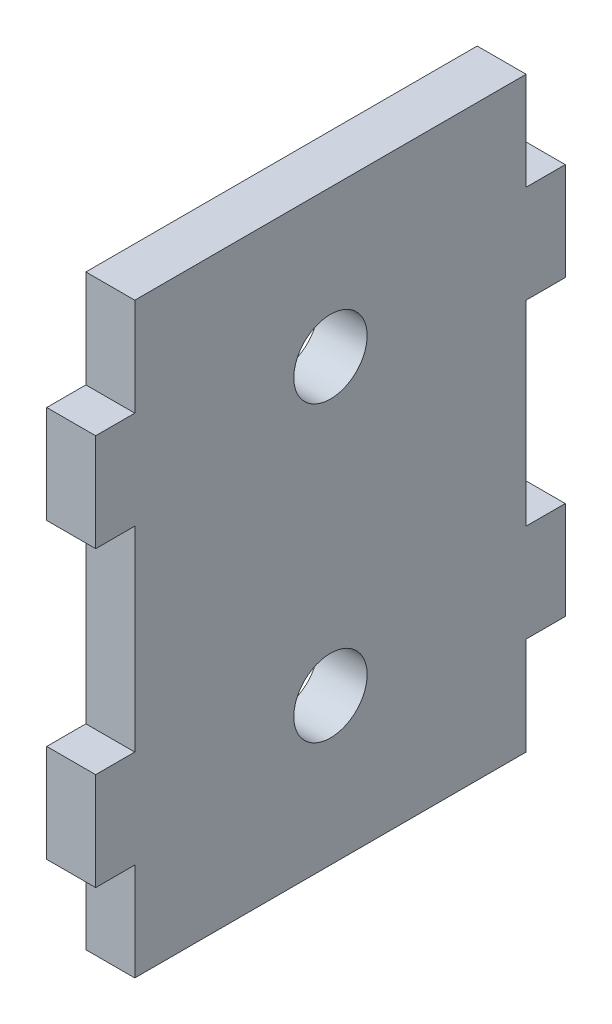
ISO-10303-21;
HEADER;
FILE_DESCRIPTION(('STEP AP214'),'2;1');
FILE_NAME('part.step','',(''),(''),'','','');
FILE_SCHEMA(('AUTOMOTIVE_DESIGN { 1 0 10303 214 1 1 1 1 }'));
ENDSEC;
DATA;
#1=APPLICATION_CONTEXT('core data for automotive mechanical design processes');
#2=APPLICATION_PROTOCOL_DEFINITION('international standard','automotive_design',2000,#1);
#3=PRODUCT_CONTEXT('',#1,'mechanical');
#4=PRODUCT('Part','Part','',(#3));
#5=PRODUCT_RELATED_PRODUCT_CATEGORY('part','',(#4));
#6=PRODUCT_DEFINITION_FORMATION('','',#4);
#7=PRODUCT_DEFINITION_CONTEXT('part definition',#1,'design');
#8=PRODUCT_DEFINITION('design','',#6,#7);
#9=PRODUCT_DEFINITION_SHAPE('','',#8);
#10=(LENGTH_UNIT() NAMED_UNIT(*) SI_UNIT(.MILLI.,.METRE.));
#11=(NAMED_UNIT(*) PLANE_ANGLE_UNIT() SI_UNIT($,.RADIAN.));
#12=(NAMED_UNIT(*) SI_UNIT($,.STERADIAN.) SOLID_ANGLE_UNIT());
#13=UNCERTAINTY_MEASURE_WITH_UNIT(LENGTH_MEASURE(1.E-05),#10,'distance_accuracy_value','');
#14=(GEOMETRIC_REPRESENTATION_CONTEXT(3) GLOBAL_UNCERTAINTY_ASSIGNED_CONTEXT((#13)) GLOBAL_UNIT_ASSIGNED_CONTEXT((#10,
#11,#12)) REPRESENTATION_CONTEXT('',''));
#15=CARTESIAN_POINT('',(0.,0.,0.));
#16=DIRECTION('',(0.,0.,1.));
#17=DIRECTION('',(1.,0.,0.));
#18=AXIS2_PLACEMENT_3D('',#15,#16,#17);
#19=CARTESIAN_POINT('',(-240.,3.33066907387547E-13,-640.));
#20=DIRECTION('',(0.,0.,1.));
#21=DIRECTION('',(1.,0.,0.));
#22=AXIS2_PLACEMENT_3D('',#19,#20,#21);
#23=PLANE('',#22);
#24=DIRECTION('',(-1.,0.,0.));
#25=VECTOR('',#24,1.);
#26=CARTESIAN_POINT('',(-240.,110.,-640.000000000001));
#27=LINE('',#26,#25);
#28=CARTESIAN_POINT('',(-240.,110.,-640.000000000001));
#29=VERTEX_POINT('',#28);
#30=CARTESIAN_POINT('',(-250.,110.000000000001,-640.));
#31=VERTEX_POINT('',#30);
#32=EDGE_CURVE('E48',#29,#31,#27,.T.);
#33=ORIENTED_EDGE('',*,*,#32,.F.);
#34=DIRECTION('',(0.,1.,0.));
#35=VECTOR('',#34,1.);
#36=CARTESIAN_POINT('',(-240.,3.33066907387547E-13,-640.));
#37=LINE('',#36,#35);
#38=CARTESIAN_POINT('',(-240.,70.0000000000005,-640.));
#39=VERTEX_POINT('',#38);
#40=EDGE_CURVE('E234',#39,#29,#37,.T.);
#41=ORIENTED_EDGE('',*,*,#40,.F.);
#42=DIRECTION('',(-1.,0.,0.));
#43=VECTOR('',#42,1.);
#44=CARTESIAN_POINT('',(-240.,70.0000000000005,-640.));
#45=LINE('',#44,#43);
#46=CARTESIAN_POINT('',(-250.,70.0000000000001,-640.));
#47=VERTEX_POINT('',#46);
#48=EDGE_CURVE('E121',#39,#47,#45,.T.);
#49=ORIENTED_EDGE('',*,*,#48,.T.);
#50=DIRECTION('',(0.,1.,0.));
#51=VECTOR('',#50,1.);
#52=CARTESIAN_POINT('',(-250.,4.44089209850063E-13,-640.));
#53=LINE('',#52,#51);
#54=EDGE_CURVE('E188',#47,#31,#53,.T.);
#55=ORIENTED_EDGE('',*,*,#54,.T.);
#56=EDGE_LOOP('',(#33,#41,#49,#55));
#57=FACE_BOUND('',#56,.T.);
#58=ADVANCED_FACE('F38',(#57),#23,.F.);
#59=CARTESIAN_POINT('',(-240.,30.0000000000004,0.));
#60=DIRECTION('',(0.,-1.,0.));
#61=DIRECTION('',(0.,0.,-1.));
#62=AXIS2_PLACEMENT_3D('',#59,#60,#61);
#63=PLANE('',#62);
#64=DIRECTION('',(0.,0.,1.));
#65=VECTOR('',#64,1.);
#66=CARTESIAN_POINT('',(-250.,30.0000000000002,0.));
#67=LINE('',#66,#65);
#68=CARTESIAN_POINT('',(-250.,30.0000000000001,-640.));
#69=VERTEX_POINT('',#68);
#70=CARTESIAN_POINT('',(-250.,30.0000000000001,-560.));
#71=VERTEX_POINT('',#70);
#72=EDGE_CURVE('E202',#69,#71,#67,.T.);
#73=ORIENTED_EDGE('',*,*,#72,.F.);
#74=DIRECTION('',(-1.,0.,0.));
#75=VECTOR('',#74,1.);
#76=CARTESIAN_POINT('',(-240.,30.0000000000005,-640.));
#77=LINE('',#76,#75);
#78=CARTESIAN_POINT('',(-240.,30.0000000000005,-640.));
#79=VERTEX_POINT('',#78);
#80=EDGE_CURVE('E109',#79,#69,#77,.T.);
#81=ORIENTED_EDGE('',*,*,#80,.F.);
#82=DIRECTION('',(0.,0.,1.));
#83=VECTOR('',#82,1.);
#84=CARTESIAN_POINT('',(-240.,30.0000000000004,0.));
#85=LINE('',#84,#83);
#86=CARTESIAN_POINT('',(-240.,30.0000000000004,-560.));
#87=VERTEX_POINT('',#86);
#88=EDGE_CURVE('E248',#79,#87,#85,.T.);
#89=ORIENTED_EDGE('',*,*,#88,.T.);
#90=DIRECTION('',(-1.,0.,0.));
#91=VECTOR('',#90,1.);
#92=CARTESIAN_POINT('',(-240.,30.0000000000004,-560.));
#93=LINE('',#92,#91);
#94=EDGE_CURVE('E154',#87,#71,#93,.T.);
#95=ORIENTED_EDGE('',*,*,#94,.T.);
#96=EDGE_LOOP('',(#73,#81,#89,#95));
#97=FACE_BOUND('',#96,.T.);
#98=ADVANCED_FACE('F385',(#97),#63,.T.);
#99=CARTESIAN_POINT('',(-250.,50.0000000000005,-640.));
#100=VERTEX_POINT('',#99);
#101=EDGE_CURVE('E199',#69,#100,#53,.T.);
#102=ORIENTED_EDGE('',*,*,#101,.T.);
#103=DIRECTION('',(-1.,0.,0.));
#104=VECTOR('',#103,1.);
#105=CARTESIAN_POINT('',(-240.,50.,-640.));
#106=LINE('',#105,#104);
#107=CARTESIAN_POINT('',(-240.,50.,-640.));
#108=VERTEX_POINT('',#107);
#109=EDGE_CURVE('E112',#108,#100,#106,.T.);
#110=ORIENTED_EDGE('',*,*,#109,.F.);
#111=EDGE_CURVE('E245',#79,#108,#37,.T.);
#112=ORIENTED_EDGE('',*,*,#111,.F.);
#113=ORIENTED_EDGE('',*,*,#80,.T.);
#114=EDGE_LOOP('',(#102,#110,#112,#113));
#115=FACE_BOUND('',#114,.T.);
#116=ADVANCED_FACE('F381',(#115),#23,.F.);
#117=CARTESIAN_POINT('',(-240.,50.0000000000002,0.));
#118=DIRECTION('',(0.,1.,0.));
#119=DIRECTION('',(0.,0.,1.));
#120=AXIS2_PLACEMENT_3D('',#117,#118,#119);
#121=PLANE('',#120);
#122=DIRECTION('',(0.,0.,-1.));
#123=VECTOR('',#122,1.);
#124=CARTESIAN_POINT('',(-250.,50.0000000000004,1.38777878078145E-13));
#125=LINE('',#124,#123);
#126=CARTESIAN_POINT('',(-250.,50.0000000000002,-648.));
#127=VERTEX_POINT('',#126);
#128=EDGE_CURVE('E196',#100,#127,#125,.T.);
#129=ORIENTED_EDGE('',*,*,#128,.T.);
#130=DIRECTION('',(-1.,0.,0.));
#131=VECTOR('',#130,1.);
#132=CARTESIAN_POINT('',(-240.,50.0000000000004,-648.));
#133=LINE('',#132,#131);
#134=CARTESIAN_POINT('',(-240.,50.0000000000004,-648.));
#135=VERTEX_POINT('',#134);
#136=EDGE_CURVE('E115',#135,#127,#133,.T.);
#137=ORIENTED_EDGE('',*,*,#136,.F.);
#138=DIRECTION('',(0.,0.,-1.));
#139=VECTOR('',#138,1.);
#140=CARTESIAN_POINT('',(-240.,50.0000000000002,0.));
#141=LINE('',#140,#139);
#142=EDGE_CURVE('E242',#108,#135,#141,.T.);
#143=ORIENTED_EDGE('',*,*,#142,.F.);
#144=ORIENTED_EDGE('',*,*,#109,.T.);
#145=EDGE_LOOP('',(#129,#137,#143,#144));
#146=FACE_BOUND('',#145,.T.);
#147=ADVANCED_FACE('F392',(#146),#121,.F.);
#148=CARTESIAN_POINT('',(-240.,5.55111512312578E-13,-648.));
#149=DIRECTION('',(0.,0.,-1.));
#150=DIRECTION('',(-1.,0.,0.));
#151=AXIS2_PLACEMENT_3D('',#148,#149,#150);
#152=PLANE('',#151);
#153=DIRECTION('',(0.,-1.,0.));
#154=VECTOR('',#153,1.);
#155=CARTESIAN_POINT('',(-250.,1.11022302462516E-13,-648.));
#156=LINE('',#155,#154);
#157=CARTESIAN_POINT('',(-250.,70.0000000000004,-648.000000000001));
#158=VERTEX_POINT('',#157);
#159=EDGE_CURVE('E193',#158,#127,#156,.T.);
#160=ORIENTED_EDGE('',*,*,#159,.F.);
#161=DIRECTION('',(-1.,0.,0.));
#162=VECTOR('',#161,1.);
#163=CARTESIAN_POINT('',(-240.,70.0000000000003,-648.));
#164=LINE('',#163,#162);
#165=CARTESIAN_POINT('',(-240.,70.0000000000003,-648.));
#166=VERTEX_POINT('',#165);
#167=EDGE_CURVE('E118',#166,#158,#164,.T.);
#168=ORIENTED_EDGE('',*,*,#167,.F.);
#169=DIRECTION('',(0.,-1.,0.));
#170=VECTOR('',#169,1.);
#171=CARTESIAN_POINT('',(-240.,5.55111512312578E-13,-648.));
#172=LINE('',#171,#170);
#173=EDGE_CURVE('E239',#166,#135,#172,.T.);
#174=ORIENTED_EDGE('',*,*,#173,.T.);
#175=ORIENTED_EDGE('',*,*,#136,.T.);
#176=EDGE_LOOP('',(#160,#168,#174,#175));
#177=FACE_BOUND('',#176,.T.);
#178=ADVANCED_FACE('F308',(#177),#152,.T.);
#179=CARTESIAN_POINT('',(-240.,70.,3.05311331771918E-13));
#180=DIRECTION('',(0.,1.,0.));
#181=DIRECTION('',(0.,0.,1.));
#182=AXIS2_PLACEMENT_3D('',#179,#180,#181);
#183=PLANE('',#182);
#184=DIRECTION('',(0.,0.,-1.));
#185=VECTOR('',#184,1.);
#186=CARTESIAN_POINT('',(-250.,70.0000000000002,0.));
#187=LINE('',#186,#185);
#188=EDGE_CURVE('E189',#47,#158,#187,.T.);
#189=ORIENTED_EDGE('',*,*,#188,.F.);
#190=ORIENTED_EDGE('',*,*,#48,.F.);
#191=DIRECTION('',(0.,0.,-1.));
#192=VECTOR('',#191,1.);
#193=CARTESIAN_POINT('',(-240.,70.,3.05311331771918E-13));
#194=LINE('',#193,#192);
#195=EDGE_CURVE('E235',#39,#166,#194,.T.);
#196=ORIENTED_EDGE('',*,*,#195,.T.);
#197=ORIENTED_EDGE('',*,*,#167,.T.);
#198=EDGE_LOOP('',(#189,#190,#196,#197));
#199=FACE_BOUND('',#198,.T.);
#200=ADVANCED_FACE('F298',(#199),#183,.T.);
#201=CARTESIAN_POINT('',(-240.,130.,-640.));
#202=VERTEX_POINT('',#201);
#203=CARTESIAN_POINT('',(-240.,150.,-640.000000000001));
#204=VERTEX_POINT('',#203);
#205=EDGE_CURVE('E238',#202,#204,#37,.T.);
#206=ORIENTED_EDGE('',*,*,#205,.F.);
#207=DIRECTION('',(-1.,0.,0.));
#208=VECTOR('',#207,1.);
#209=CARTESIAN_POINT('',(-240.,130.,-640.));
#210=LINE('',#209,#208);
#211=CARTESIAN_POINT('',(-250.,130.,-640.));
#212=VERTEX_POINT('',#211);
#213=EDGE_CURVE('E11',#202,#212,#210,.T.);
#214=ORIENTED_EDGE('',*,*,#213,.T.);
#215=CARTESIAN_POINT('',(-250.,150.,-640.));
#216=VERTEX_POINT('',#215);
#217=EDGE_CURVE('E192',#212,#216,#53,.T.);
#218=ORIENTED_EDGE('',*,*,#217,.T.);
#219=DIRECTION('',(-1.,0.,0.));
#220=VECTOR('',#219,1.);
#221=CARTESIAN_POINT('',(-240.,150.,-640.000000000001));
#222=LINE('',#221,#220);
#223=EDGE_CURVE('E124',#204,#216,#222,.T.);
#224=ORIENTED_EDGE('',*,*,#223,.F.);
#225=EDGE_LOOP('',(#206,#214,#218,#224));
#226=FACE_BOUND('',#225,.T.);
#227=ADVANCED_FACE('F394',(#226),#23,.F.);
#228=CARTESIAN_POINT('',(-240.,150.,0.));
#229=DIRECTION('',(0.,-1.,0.));
#230=DIRECTION('',(0.,0.,-1.));
#231=AXIS2_PLACEMENT_3D('',#228,#229,#230);
#232=PLANE('',#231);
#233=DIRECTION('',(0.,0.,1.));
#234=VECTOR('',#233,1.);
#235=CARTESIAN_POINT('',(-250.,150.,0.));
#236=LINE('',#235,#234);
#237=CARTESIAN_POINT('',(-250.,150.,-560.));
#238=VERTEX_POINT('',#237);
#239=EDGE_CURVE('E185',#216,#238,#236,.T.);
#240=ORIENTED_EDGE('',*,*,#239,.T.);
#241=DIRECTION('',(-1.,0.,0.));
#242=VECTOR('',#241,1.);
#243=CARTESIAN_POINT('',(-240.,150.,-560.000000000001));
#244=LINE('',#243,#242);
#245=CARTESIAN_POINT('',(-240.,150.,-560.000000000001));
#246=VERTEX_POINT('',#245);
#247=EDGE_CURVE('E127',#246,#238,#244,.T.);
#248=ORIENTED_EDGE('',*,*,#247,.F.);
#249=DIRECTION('',(0.,0.,1.));
#250=VECTOR('',#249,1.);
#251=CARTESIAN_POINT('',(-240.,150.,0.));
#252=LINE('',#251,#250);
#253=EDGE_CURVE('E231',#204,#246,#252,.T.);
#254=ORIENTED_EDGE('',*,*,#253,.F.);
#255=ORIENTED_EDGE('',*,*,#223,.T.);
#256=EDGE_LOOP('',(#240,#248,#254,#255));
#257=FACE_BOUND('',#256,.T.);
#258=ADVANCED_FACE('F416',(#257),#232,.F.);
#259=CARTESIAN_POINT('',(-240.,-2.22044604925031E-13,-560.));
#260=DIRECTION('',(0.,0.,1.));
#261=DIRECTION('',(0.,-1.,0.));
#262=AXIS2_PLACEMENT_3D('',#259,#260,#261);
#263=PLANE('',#262);
#264=DIRECTION('',(0.,1.,0.));
#265=VECTOR('',#264,1.);
#266=CARTESIAN_POINT('',(-250.,-1.11022302462516E-13,-560.000000000001));
#267=LINE('',#266,#265);
#268=CARTESIAN_POINT('',(-250.,130.,-560.));
#269=VERTEX_POINT('',#268);
#270=EDGE_CURVE('E182',#269,#238,#267,.T.);
#271=ORIENTED_EDGE('',*,*,#270,.F.);
#272=DIRECTION('',(-1.,0.,0.));
#273=VECTOR('',#272,1.);
#274=CARTESIAN_POINT('',(-240.,130.,-560.000000000001));
#275=LINE('',#274,#273);
#276=CARTESIAN_POINT('',(-240.,130.,-560.000000000001));
#277=VERTEX_POINT('',#276);
#278=EDGE_CURVE('E130',#277,#269,#275,.T.);
#279=ORIENTED_EDGE('',*,*,#278,.F.);
#280=DIRECTION('',(0.,1.,0.));
#281=VECTOR('',#280,1.);
#282=CARTESIAN_POINT('',(-240.,-2.22044604925031E-13,-560.));
#283=LINE('',#282,#281);
#284=EDGE_CURVE('E228',#277,#246,#283,.T.);
#285=ORIENTED_EDGE('',*,*,#284,.T.);
#286=ORIENTED_EDGE('',*,*,#247,.T.);
#287=EDGE_LOOP('',(#271,#279,#285,#286));
#288=FACE_BOUND('',#287,.T.);
#289=ADVANCED_FACE('F406',(#288),#263,.T.);
#290=CARTESIAN_POINT('',(-240.,130.,0.));
#291=DIRECTION('',(0.,-1.,0.));
#292=DIRECTION('',(0.,0.,-1.));
#293=AXIS2_PLACEMENT_3D('',#290,#291,#292);
#294=PLANE('',#293);
#295=DIRECTION('',(0.,0.,1.));
#296=VECTOR('',#295,1.);
#297=CARTESIAN_POINT('',(-250.,130.,1.38777878078145E-13));
#298=LINE('',#297,#296);
#299=CARTESIAN_POINT('',(-250.,130.000000000001,-552.));
#300=VERTEX_POINT('',#299);
#301=EDGE_CURVE('E179',#269,#300,#298,.T.);
#302=ORIENTED_EDGE('',*,*,#301,.T.);
#303=DIRECTION('',(-1.,0.,0.));
#304=VECTOR('',#303,1.);
#305=CARTESIAN_POINT('',(-240.,130.,-552.));
#306=LINE('',#305,#304);
#307=CARTESIAN_POINT('',(-240.,130.,-552.));
#308=VERTEX_POINT('',#307);
#309=EDGE_CURVE('E133',#308,#300,#306,.T.);
#310=ORIENTED_EDGE('',*,*,#309,.F.);
#311=DIRECTION('',(0.,0.,1.));
#312=VECTOR('',#311,1.);
#313=CARTESIAN_POINT('',(-240.,130.,0.));
#314=LINE('',#313,#312);
#315=EDGE_CURVE('E225',#277,#308,#314,.T.);
#316=ORIENTED_EDGE('',*,*,#315,.F.);
#317=ORIENTED_EDGE('',*,*,#278,.T.);
#318=EDGE_LOOP('',(#302,#310,#316,#317));
#319=FACE_BOUND('',#318,.T.);
#320=ADVANCED_FACE('F415',(#319),#294,.F.);
#321=CARTESIAN_POINT('',(-240.,-2.77555756156289E-12,-551.999999999999));
#322=DIRECTION('',(0.,0.,-1.));
#323=DIRECTION('',(0.,0.999999999999999,0.));
#324=AXIS2_PLACEMENT_3D('',#321,#322,#323);
#325=PLANE('',#324);
#326=DIRECTION('',(0.,-0.999999999999999,0.));
#327=VECTOR('',#326,1.);
#328=CARTESIAN_POINT('',(-250.,-2.88657986402541E-12,-552.));
#329=LINE('',#328,#327);
#330=CARTESIAN_POINT('',(-250.,110.,-552.));
#331=VERTEX_POINT('',#330);
#332=EDGE_CURVE('E176',#300,#331,#329,.T.);
#333=ORIENTED_EDGE('',*,*,#332,.T.);
#334=DIRECTION('',(-1.,0.,0.));
#335=VECTOR('',#334,1.);
#336=CARTESIAN_POINT('',(-240.,110.,-552.));
#337=LINE('',#336,#335);
#338=CARTESIAN_POINT('',(-240.,110.,-552.));
#339=VERTEX_POINT('',#338);
#340=EDGE_CURVE('E136',#339,#331,#337,.T.);
#341=ORIENTED_EDGE('',*,*,#340,.F.);
#342=DIRECTION('',(0.,-0.999999999999999,0.));
#343=VECTOR('',#342,1.);
#344=CARTESIAN_POINT('',(-240.,-2.77555756156289E-12,-551.999999999999));
#345=LINE('',#344,#343);
#346=EDGE_CURVE('E222',#308,#339,#345,.T.);
#347=ORIENTED_EDGE('',*,*,#346,.F.);
#348=ORIENTED_EDGE('',*,*,#309,.T.);
#349=EDGE_LOOP('',(#333,#341,#347,#348));
#350=FACE_BOUND('',#349,.T.);
#351=ADVANCED_FACE('F428',(#350),#325,.F.);
#352=CARTESIAN_POINT('',(-240.,110.,0.));
#353=DIRECTION('',(0.,-1.,0.));
#354=DIRECTION('',(0.,0.,-1.));
#355=AXIS2_PLACEMENT_3D('',#352,#353,#354);
#356=PLANE('',#355);
#357=DIRECTION('',(0.,0.,1.));
#358=VECTOR('',#357,1.);
#359=CARTESIAN_POINT('',(-250.,110.,0.));
#360=LINE('',#359,#358);
#361=CARTESIAN_POINT('',(-250.,110.000000000001,-560.));
#362=VERTEX_POINT('',#361);
#363=EDGE_CURVE('E173',#362,#331,#360,.T.);
#364=ORIENTED_EDGE('',*,*,#363,.F.);
#365=DIRECTION('',(-1.,0.,0.));
#366=VECTOR('',#365,1.);
#367=CARTESIAN_POINT('',(-240.,110.,-560.));
#368=LINE('',#367,#366);
#369=CARTESIAN_POINT('',(-240.,110.,-560.));
#370=VERTEX_POINT('',#369);
#371=EDGE_CURVE('E139',#370,#362,#368,.T.);
#372=ORIENTED_EDGE('',*,*,#371,.F.);
#373=DIRECTION('',(0.,0.,1.));
#374=VECTOR('',#373,1.);
#375=CARTESIAN_POINT('',(-240.,110.,0.));
#376=LINE('',#375,#374);
#377=EDGE_CURVE('E219',#370,#339,#376,.T.);
#378=ORIENTED_EDGE('',*,*,#377,.T.);
#379=ORIENTED_EDGE('',*,*,#340,.T.);
#380=EDGE_LOOP('',(#364,#372,#378,#379));
#381=FACE_BOUND('',#380,.T.);
#382=ADVANCED_FACE('F420',(#381),#356,.T.);
#383=CARTESIAN_POINT('',(-250.,70.0000000000001,-560.));
#384=VERTEX_POINT('',#383);
#385=EDGE_CURVE('E172',#384,#362,#267,.T.);
#386=ORIENTED_EDGE('',*,*,#385,.F.);
#387=DIRECTION('',(-1.,0.,0.));
#388=VECTOR('',#387,1.);
#389=CARTESIAN_POINT('',(-240.,70.0000000000003,-560.000000000001));
#390=LINE('',#389,#388);
#391=CARTESIAN_POINT('',(-240.,70.0000000000003,-560.000000000001));
#392=VERTEX_POINT('',#391);
#393=EDGE_CURVE('E142',#392,#384,#390,.T.);
#394=ORIENTED_EDGE('',*,*,#393,.F.);
#395=EDGE_CURVE('E218',#392,#370,#283,.T.);
#396=ORIENTED_EDGE('',*,*,#395,.T.);
#397=ORIENTED_EDGE('',*,*,#371,.T.);
#398=EDGE_LOOP('',(#386,#394,#396,#397));
#399=FACE_BOUND('',#398,.T.);
#400=ADVANCED_FACE('F407',(#399),#263,.T.);
#401=CARTESIAN_POINT('',(-240.,70.,3.05311331771918E-13));
#402=DIRECTION('',(0.,-1.,0.));
#403=DIRECTION('',(0.,0.,-1.));
#404=AXIS2_PLACEMENT_3D('',#401,#402,#403);
#405=PLANE('',#404);
#406=DIRECTION('',(0.,0.,1.));
#407=VECTOR('',#406,1.);
#408=CARTESIAN_POINT('',(-250.,70.0000000000002,0.));
#409=LINE('',#408,#407);
#410=CARTESIAN_POINT('',(-250.,70.0000000000004,-552.));
#411=VERTEX_POINT('',#410);
#412=EDGE_CURVE('E169',#384,#411,#409,.T.);
#413=ORIENTED_EDGE('',*,*,#412,.T.);
#414=DIRECTION('',(-1.,0.,0.));
#415=VECTOR('',#414,1.);
#416=CARTESIAN_POINT('',(-240.,70.0000000000003,-552.));
#417=LINE('',#416,#415);
#418=CARTESIAN_POINT('',(-240.,70.0000000000003,-552.));
#419=VERTEX_POINT('',#418);
#420=EDGE_CURVE('E145',#419,#411,#417,.T.);
#421=ORIENTED_EDGE('',*,*,#420,.F.);
#422=DIRECTION('',(0.,0.,1.));
#423=VECTOR('',#422,1.);
#424=CARTESIAN_POINT('',(-240.,70.,3.05311331771918E-13));
#425=LINE('',#424,#423);
#426=EDGE_CURVE('E215',#392,#419,#425,.T.);
#427=ORIENTED_EDGE('',*,*,#426,.F.);
#428=ORIENTED_EDGE('',*,*,#393,.T.);
#429=EDGE_LOOP('',(#413,#421,#427,#428));
#430=FACE_BOUND('',#429,.T.);
#431=ADVANCED_FACE('F419',(#430),#405,.F.);
#432=CARTESIAN_POINT('',(-240.,3.33066907387547E-13,-552.));
#433=DIRECTION('',(0.,0.,-1.));
#434=DIRECTION('',(-1.,0.,0.));
#435=AXIS2_PLACEMENT_3D('',#432,#433,#434);
#436=PLANE('',#435);
#437=DIRECTION('',(0.,-1.,0.));
#438=VECTOR('',#437,1.);
#439=CARTESIAN_POINT('',(-250.,4.44089209850063E-13,-552.));
#440=LINE('',#439,#438);
#441=CARTESIAN_POINT('',(-250.,50.0000000000005,-552.));
#442=VERTEX_POINT('',#441);
#443=EDGE_CURVE('E166',#411,#442,#440,.T.);
#444=ORIENTED_EDGE('',*,*,#443,.T.);
#445=DIRECTION('',(-1.,0.,0.));
#446=VECTOR('',#445,1.);
#447=CARTESIAN_POINT('',(-240.,50.0000000000005,-552.));
#448=LINE('',#447,#446);
#449=CARTESIAN_POINT('',(-240.,50.0000000000005,-552.));
#450=VERTEX_POINT('',#449);
#451=EDGE_CURVE('E148',#450,#442,#448,.T.);
#452=ORIENTED_EDGE('',*,*,#451,.F.);
#453=DIRECTION('',(0.,-1.,0.));
#454=VECTOR('',#453,1.);
#455=CARTESIAN_POINT('',(-240.,3.33066907387547E-13,-552.));
#456=LINE('',#455,#454);
#457=EDGE_CURVE('E212',#419,#450,#456,.T.);
#458=ORIENTED_EDGE('',*,*,#457,.F.);
#459=ORIENTED_EDGE('',*,*,#420,.T.);
#460=EDGE_LOOP('',(#444,#452,#458,#459));
#461=FACE_BOUND('',#460,.T.);
#462=ADVANCED_FACE('F411',(#461),#436,.F.);
#463=CARTESIAN_POINT('',(-240.,50.0000000000002,0.));
#464=DIRECTION('',(0.,-1.,0.));
#465=DIRECTION('',(0.,0.,-1.));
#466=AXIS2_PLACEMENT_3D('',#463,#464,#465);
#467=PLANE('',#466);
#468=DIRECTION('',(0.,0.,1.));
#469=VECTOR('',#468,1.);
#470=CARTESIAN_POINT('',(-250.,50.0000000000004,1.38777878078145E-13));
#471=LINE('',#470,#469);
#472=CARTESIAN_POINT('',(-250.,50.0000000000004,-560.));
#473=VERTEX_POINT('',#472);
#474=EDGE_CURVE('E163',#473,#442,#471,.T.);
#475=ORIENTED_EDGE('',*,*,#474,.F.);
#476=DIRECTION('',(-1.,0.,0.));
#477=VECTOR('',#476,1.);
#478=CARTESIAN_POINT('',(-240.,49.9999999999999,-560.));
#479=LINE('',#478,#477);
#480=CARTESIAN_POINT('',(-240.,49.9999999999999,-560.));
#481=VERTEX_POINT('',#480);
#482=EDGE_CURVE('E151',#481,#473,#479,.T.);
#483=ORIENTED_EDGE('',*,*,#482,.F.);
#484=DIRECTION('',(0.,0.,1.));
#485=VECTOR('',#484,1.);
#486=CARTESIAN_POINT('',(-240.,50.0000000000002,0.));
#487=LINE('',#486,#485);
#488=EDGE_CURVE('E209',#481,#450,#487,.T.);
#489=ORIENTED_EDGE('',*,*,#488,.T.);
#490=ORIENTED_EDGE('',*,*,#451,.T.);
#491=EDGE_LOOP('',(#475,#483,#489,#490));
#492=FACE_BOUND('',#491,.T.);
#493=ADVANCED_FACE('F403',(#492),#467,.T.);
#494=EDGE_CURVE('E162',#71,#473,#267,.T.);
#495=ORIENTED_EDGE('',*,*,#494,.F.);
#496=ORIENTED_EDGE('',*,*,#94,.F.);
#497=EDGE_CURVE('E208',#87,#481,#283,.T.);
#498=ORIENTED_EDGE('',*,*,#497,.T.);
#499=ORIENTED_EDGE('',*,*,#482,.T.);
#500=EDGE_LOOP('',(#495,#496,#498,#499));
#501=FACE_BOUND('',#500,.T.);
#502=ADVANCED_FACE('F399',(#501),#263,.T.);
#503=CARTESIAN_POINT('',(-240.,120.,-600.));
#504=DIRECTION('',(-1.,0.,0.));
#505=DIRECTION('',(0.,0.,1.));
#506=AXIS2_PLACEMENT_3D('',#503,#504,#505);
#507=CYLINDRICAL_SURFACE('',#506,7.49999999999996);
#508=CARTESIAN_POINT('',(-240.,120.,-600.));
#509=DIRECTION('',(1.,0.,0.));
#510=DIRECTION('',(0.,0.,-1.));
#511=AXIS2_PLACEMENT_3D('',#508,#509,#510);
#512=CIRCLE('',#511,7.49999999999996);
#513=CARTESIAN_POINT('',(-240.,120.,-607.5));
#514=VERTEX_POINT('',#513);
#515=EDGE_CURVE('E161',#514,#514,#512,.T.);
#516=ORIENTED_EDGE('',*,*,#515,.T.);
#517=EDGE_LOOP('',(#516));
#518=FACE_BOUND('',#517,.T.);
#519=CARTESIAN_POINT('',(-250.,120.000000000001,-600.));
#520=DIRECTION('',(1.,0.,0.));
#521=DIRECTION('',(0.,0.,-1.));
#522=AXIS2_PLACEMENT_3D('',#519,#520,#521);
#523=CIRCLE('',#522,7.49999999999996);
#524=CARTESIAN_POINT('',(-250.,120.000000000001,-607.5));
#525=VERTEX_POINT('',#524);
#526=EDGE_CURVE('E85',#525,#525,#523,.T.);
#527=ORIENTED_EDGE('',*,*,#526,.F.);
#528=EDGE_LOOP('',(#527));
#529=FACE_BOUND('',#528,.T.);
#530=ADVANCED_FACE('F254',(#518,#529),#507,.F.);
#531=CARTESIAN_POINT('',(-240.,60.0000000000007,-600.));
#532=DIRECTION('',(-1.,0.,0.));
#533=DIRECTION('',(0.,0.,1.));
#534=AXIS2_PLACEMENT_3D('',#531,#532,#533);
#535=CYLINDRICAL_SURFACE('',#534,7.49999999999995);
#536=CARTESIAN_POINT('',(-240.,60.0000000000007,-600.));
#537=DIRECTION('',(1.,0.,0.));
#538=DIRECTION('',(0.,0.,-1.));
#539=AXIS2_PLACEMENT_3D('',#536,#537,#538);
#540=CIRCLE('',#539,7.49999999999995);
#541=CARTESIAN_POINT('',(-240.,60.0000000000007,-607.5));
#542=VERTEX_POINT('',#541);
#543=EDGE_CURVE('E157',#542,#542,#540,.T.);
#544=ORIENTED_EDGE('',*,*,#543,.T.);
#545=EDGE_LOOP('',(#544));
#546=FACE_BOUND('',#545,.T.);
#547=CARTESIAN_POINT('',(-250.,60.0000000000005,-600.));
#548=DIRECTION('',(1.,0.,0.));
#549=DIRECTION('',(0.,0.,-1.));
#550=AXIS2_PLACEMENT_3D('',#547,#548,#549);
#551=CIRCLE('',#550,7.49999999999995);
#552=CARTESIAN_POINT('',(-250.,60.0000000000005,-607.5));
#553=VERTEX_POINT('',#552);
#554=EDGE_CURVE('E158',#553,#553,#551,.T.);
#555=ORIENTED_EDGE('',*,*,#554,.F.);
#556=EDGE_LOOP('',(#555));
#557=FACE_BOUND('',#556,.T.);
#558=ADVANCED_FACE('F260',(#546,#557),#535,.F.);
#559=CARTESIAN_POINT('',(-240.,1.11022302462516E-13,3.05311331771918E-13));
#560=DIRECTION('',(1.,0.,0.));
#561=DIRECTION('',(0.,0.,-1.));
#562=AXIS2_PLACEMENT_3D('',#559,#560,#561);
#563=PLANE('',#562);
#564=ORIENTED_EDGE('',*,*,#515,.F.);
#565=EDGE_LOOP('',(#564));
#566=FACE_BOUND('',#565,.T.);
#567=ORIENTED_EDGE('',*,*,#88,.F.);
#568=ORIENTED_EDGE('',*,*,#111,.T.);
#569=ORIENTED_EDGE('',*,*,#142,.T.);
#570=ORIENTED_EDGE('',*,*,#173,.F.);
#571=ORIENTED_EDGE('',*,*,#195,.F.);
#572=ORIENTED_EDGE('',*,*,#40,.T.);
#573=DIRECTION('',(0.,0.,-1.));
#574=VECTOR('',#573,1.);
#575=CARTESIAN_POINT('',(-240.,110.,-640.000000000001));
#576=LINE('',#575,#574);
#577=CARTESIAN_POINT('',(-240.,110.,-648.));
#578=VERTEX_POINT('',#577);
#579=EDGE_CURVE('E104',#29,#578,#576,.T.);
#580=ORIENTED_EDGE('',*,*,#579,.T.);
#581=DIRECTION('',(0.,-1.,0.));
#582=VECTOR('',#581,1.);
#583=CARTESIAN_POINT('',(-240.,130.,-648.));
#584=LINE('',#583,#582);
#585=CARTESIAN_POINT('',(-240.,130.,-648.));
#586=VERTEX_POINT('',#585);
#587=EDGE_CURVE('E82',#586,#578,#584,.T.);
#588=ORIENTED_EDGE('',*,*,#587,.F.);
#589=DIRECTION('',(0.,0.,-1.));
#590=VECTOR('',#589,1.);
#591=CARTESIAN_POINT('',(-240.,130.,-640.));
#592=LINE('',#591,#590);
#593=EDGE_CURVE('E94',#202,#586,#592,.T.);
#594=ORIENTED_EDGE('',*,*,#593,.F.);
#595=ORIENTED_EDGE('',*,*,#205,.T.);
#596=ORIENTED_EDGE('',*,*,#253,.T.);
#597=ORIENTED_EDGE('',*,*,#284,.F.);
#598=ORIENTED_EDGE('',*,*,#315,.T.);
#599=ORIENTED_EDGE('',*,*,#346,.T.);
#600=ORIENTED_EDGE('',*,*,#377,.F.);
#601=ORIENTED_EDGE('',*,*,#395,.F.);
#602=ORIENTED_EDGE('',*,*,#426,.T.);
#603=ORIENTED_EDGE('',*,*,#457,.T.);
#604=ORIENTED_EDGE('',*,*,#488,.F.);
#605=ORIENTED_EDGE('',*,*,#497,.F.);
#606=EDGE_LOOP('',(#567,#568,#569,#570,#571,#572,#580,#588,#594,#595,#596,#597,#598,#599,#600,
#601,#602,#603,#604,#605));
#607=FACE_BOUND('',#606,.T.);
#608=ORIENTED_EDGE('',*,*,#543,.F.);
#609=EDGE_LOOP('',(#608));
#610=FACE_BOUND('',#609,.T.);
#611=ADVANCED_FACE('F257',(#566,#607,#610),#563,.T.);
#612=CARTESIAN_POINT('',(-250.,3.33066907387547E-13,0.));
#613=DIRECTION('',(1.,0.,0.));
#614=DIRECTION('',(0.,0.,-1.));
#615=AXIS2_PLACEMENT_3D('',#612,#613,#614);
#616=PLANE('',#615);
#617=ORIENTED_EDGE('',*,*,#526,.T.);
#618=EDGE_LOOP('',(#617));
#619=FACE_BOUND('',#618,.T.);
#620=ORIENTED_EDGE('',*,*,#72,.T.);
#621=ORIENTED_EDGE('',*,*,#494,.T.);
#622=ORIENTED_EDGE('',*,*,#474,.T.);
#623=ORIENTED_EDGE('',*,*,#443,.F.);
#624=ORIENTED_EDGE('',*,*,#412,.F.);
#625=ORIENTED_EDGE('',*,*,#385,.T.);
#626=ORIENTED_EDGE('',*,*,#363,.T.);
#627=ORIENTED_EDGE('',*,*,#332,.F.);
#628=ORIENTED_EDGE('',*,*,#301,.F.);
#629=ORIENTED_EDGE('',*,*,#270,.T.);
#630=ORIENTED_EDGE('',*,*,#239,.F.);
#631=ORIENTED_EDGE('',*,*,#217,.F.);
#632=DIRECTION('',(0.,0.,-1.));
#633=VECTOR('',#632,1.);
#634=CARTESIAN_POINT('',(-250.,130.,-640.));
#635=LINE('',#634,#633);
#636=CARTESIAN_POINT('',(-250.,130.,-648.));
#637=VERTEX_POINT('',#636);
#638=EDGE_CURVE('E100',#212,#637,#635,.T.);
#639=ORIENTED_EDGE('',*,*,#638,.T.);
#640=DIRECTION('',(0.,-1.,0.));
#641=VECTOR('',#640,1.);
#642=CARTESIAN_POINT('',(-250.,130.,-648.));
#643=LINE('',#642,#641);
#644=CARTESIAN_POINT('',(-250.,110.,-648.000000000001));
#645=VERTEX_POINT('',#644);
#646=EDGE_CURVE('E79',#637,#645,#643,.T.);
#647=ORIENTED_EDGE('',*,*,#646,.T.);
#648=DIRECTION('',(0.,0.,-1.));
#649=VECTOR('',#648,1.);
#650=CARTESIAN_POINT('',(-250.,110.000000000001,-640.));
#651=LINE('',#650,#649);
#652=EDGE_CURVE('E88',#31,#645,#651,.T.);
#653=ORIENTED_EDGE('',*,*,#652,.F.);
#654=ORIENTED_EDGE('',*,*,#54,.F.);
#655=ORIENTED_EDGE('',*,*,#188,.T.);
#656=ORIENTED_EDGE('',*,*,#159,.T.);
#657=ORIENTED_EDGE('',*,*,#128,.F.);
#658=ORIENTED_EDGE('',*,*,#101,.F.);
#659=EDGE_LOOP('',(#620,#621,#622,#623,#624,#625,#626,#627,#628,#629,#630,#631,#639,#647,#653,
#654,#655,#656,#657,#658));
#660=FACE_BOUND('',#659,.T.);
#661=ORIENTED_EDGE('',*,*,#554,.T.);
#662=EDGE_LOOP('',(#661));
#663=FACE_BOUND('',#662,.T.);
#664=ADVANCED_FACE('F97',(#619,#660,#663),#616,.F.);
#665=CARTESIAN_POINT('',(-240.,110.,-640.000000000001));
#666=DIRECTION('',(0.,1.,0.));
#667=DIRECTION('',(0.,0.,1.));
#668=AXIS2_PLACEMENT_3D('',#665,#666,#667);
#669=PLANE('',#668);
#670=ORIENTED_EDGE('',*,*,#652,.T.);
#671=DIRECTION('',(-1.,0.,0.));
#672=VECTOR('',#671,1.);
#673=CARTESIAN_POINT('',(-240.,110.,-648.));
#674=LINE('',#673,#672);
#675=EDGE_CURVE('E75',#578,#645,#674,.T.);
#676=ORIENTED_EDGE('',*,*,#675,.F.);
#677=ORIENTED_EDGE('',*,*,#579,.F.);
#678=ORIENTED_EDGE('',*,*,#32,.T.);
#679=EDGE_LOOP('',(#670,#676,#677,#678));
#680=FACE_BOUND('',#679,.T.);
#681=ADVANCED_FACE('F89',(#680),#669,.F.);
#682=CARTESIAN_POINT('',(-240.,130.,-648.));
#683=DIRECTION('',(0.,0.,-1.));
#684=DIRECTION('',(0.,1.,0.));
#685=AXIS2_PLACEMENT_3D('',#682,#683,#684);
#686=PLANE('',#685);
#687=ORIENTED_EDGE('',*,*,#646,.F.);
#688=DIRECTION('',(-1.,0.,0.));
#689=VECTOR('',#688,1.);
#690=CARTESIAN_POINT('',(-240.,130.,-648.));
#691=LINE('',#690,#689);
#692=EDGE_CURVE('E42',#586,#637,#691,.T.);
#693=ORIENTED_EDGE('',*,*,#692,.F.);
#694=ORIENTED_EDGE('',*,*,#587,.T.);
#695=ORIENTED_EDGE('',*,*,#675,.T.);
#696=EDGE_LOOP('',(#687,#693,#694,#695));
#697=FACE_BOUND('',#696,.T.);
#698=ADVANCED_FACE('F77',(#697),#686,.T.);
#699=CARTESIAN_POINT('',(-240.,130.,-640.));
#700=DIRECTION('',(0.,1.,0.));
#701=DIRECTION('',(0.,0.,1.));
#702=AXIS2_PLACEMENT_3D('',#699,#700,#701);
#703=PLANE('',#702);
#704=ORIENTED_EDGE('',*,*,#638,.F.);
#705=ORIENTED_EDGE('',*,*,#213,.F.);
#706=ORIENTED_EDGE('',*,*,#593,.T.);
#707=ORIENTED_EDGE('',*,*,#692,.T.);
#708=EDGE_LOOP('',(#704,#705,#706,#707));
#709=FACE_BOUND('',#708,.T.);
#710=ADVANCED_FACE('F40',(#709),#703,.T.);
#711=CLOSED_SHELL('',(#58,#98,#116,#147,#178,#200,#227,#258,#289,#320,#351,#382,#400,#431,#462,
#493,#502,#530,#558,#611,#664,#681,#698,#710));
#712=MANIFOLD_SOLID_BREP('B2',#711);
#713=ADVANCED_BREP_SHAPE_REPRESENTATION('',(#18,#712),#14);
#714=SHAPE_DEFINITION_REPRESENTATION(#9,#713);
ENDSEC;
END-ISO-10303-21;
